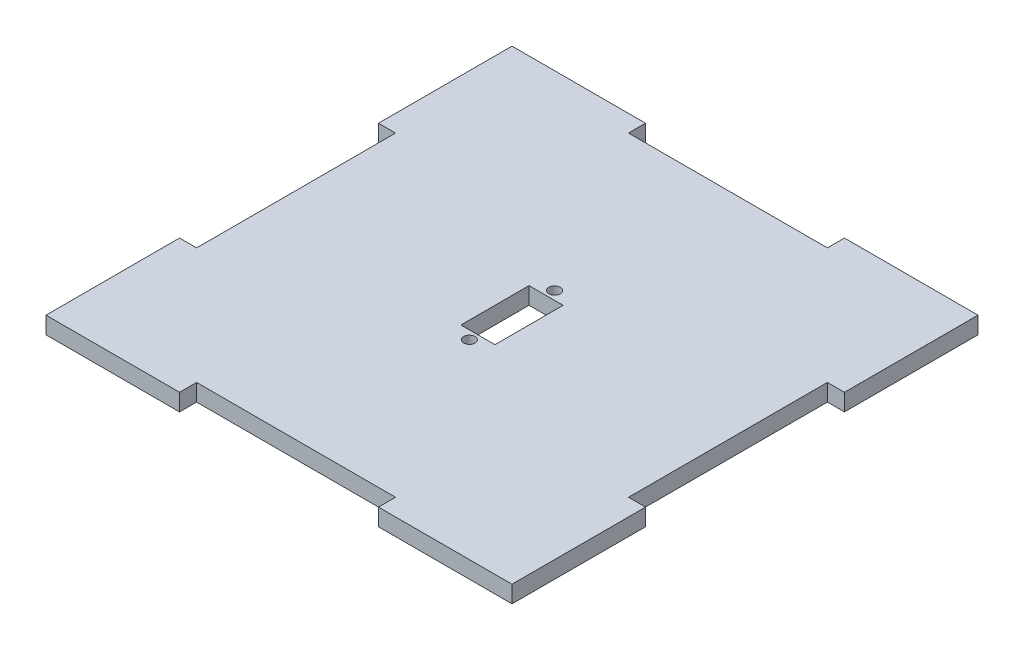
ISO-10303-21;
HEADER;
FILE_DESCRIPTION(('STEP AP214'),'2;1');
FILE_NAME('part.step','',(''),(''),'','','');
FILE_SCHEMA(('AUTOMOTIVE_DESIGN { 1 0 10303 214 1 1 1 1 }'));
ENDSEC;
DATA;
#1=APPLICATION_CONTEXT('core data for automotive mechanical design processes');
#2=APPLICATION_PROTOCOL_DEFINITION('international standard','automotive_design',2000,#1);
#3=PRODUCT_CONTEXT('',#1,'mechanical');
#4=PRODUCT('Part','Part','',(#3));
#5=PRODUCT_RELATED_PRODUCT_CATEGORY('part','',(#4));
#6=PRODUCT_DEFINITION_FORMATION('','',#4);
#7=PRODUCT_DEFINITION_CONTEXT('part definition',#1,'design');
#8=PRODUCT_DEFINITION('design','',#6,#7);
#9=PRODUCT_DEFINITION_SHAPE('','',#8);
#10=(LENGTH_UNIT() NAMED_UNIT(*) SI_UNIT(.MILLI.,.METRE.));
#11=(NAMED_UNIT(*) PLANE_ANGLE_UNIT() SI_UNIT($,.RADIAN.));
#12=(NAMED_UNIT(*) SI_UNIT($,.STERADIAN.) SOLID_ANGLE_UNIT());
#13=UNCERTAINTY_MEASURE_WITH_UNIT(LENGTH_MEASURE(1.E-05),#10,'distance_accuracy_value','');
#14=(GEOMETRIC_REPRESENTATION_CONTEXT(3) GLOBAL_UNCERTAINTY_ASSIGNED_CONTEXT((#13)) GLOBAL_UNIT_ASSIGNED_CONTEXT((#10,
#11,#12)) REPRESENTATION_CONTEXT('',''));
#15=CARTESIAN_POINT('',(0.,0.,0.));
#16=DIRECTION('',(0.,0.,1.));
#17=DIRECTION('',(1.,0.,0.));
#18=AXIS2_PLACEMENT_3D('',#15,#16,#17);
#19=CARTESIAN_POINT('',(41.,3.,-17.5));
#20=DIRECTION('',(-1.,0.,0.));
#21=DIRECTION('',(0.,0.,1.));
#22=AXIS2_PLACEMENT_3D('',#19,#20,#21);
#23=PLANE('',#22);
#24=DIRECTION('',(0.,0.,-1.));
#25=VECTOR('',#24,1.);
#26=CARTESIAN_POINT('',(41.,0.,-17.5));
#27=LINE('',#26,#25);
#28=CARTESIAN_POINT('',(41.,0.,-17.5));
#29=VERTEX_POINT('',#28);
#30=CARTESIAN_POINT('',(41.,0.,-41.));
#31=VERTEX_POINT('',#30);
#32=EDGE_CURVE('E246',#29,#31,#27,.T.);
#33=ORIENTED_EDGE('',*,*,#32,.T.);
#34=DIRECTION('',(0.,-1.,0.));
#35=VECTOR('',#34,1.);
#36=CARTESIAN_POINT('',(41.,3.,-41.));
#37=LINE('',#36,#35);
#38=CARTESIAN_POINT('',(41.,3.,-41.));
#39=VERTEX_POINT('',#38);
#40=EDGE_CURVE('E11',#39,#31,#37,.T.);
#41=ORIENTED_EDGE('',*,*,#40,.F.);
#42=DIRECTION('',(0.,0.,-1.));
#43=VECTOR('',#42,1.);
#44=CARTESIAN_POINT('',(41.,3.,-17.5));
#45=LINE('',#44,#43);
#46=CARTESIAN_POINT('',(41.,3.,-17.5));
#47=VERTEX_POINT('',#46);
#48=EDGE_CURVE('E252',#47,#39,#45,.T.);
#49=ORIENTED_EDGE('',*,*,#48,.F.);
#50=DIRECTION('',(0.,-1.,0.));
#51=VECTOR('',#50,1.);
#52=CARTESIAN_POINT('',(41.,3.,-17.5));
#53=LINE('',#52,#51);
#54=EDGE_CURVE('E314',#47,#29,#53,.T.);
#55=ORIENTED_EDGE('',*,*,#54,.T.);
#56=EDGE_LOOP('',(#33,#41,#49,#55));
#57=FACE_BOUND('',#56,.T.);
#58=ADVANCED_FACE('F38',(#57),#23,.F.);
#59=CARTESIAN_POINT('',(17.5,3.,-41.));
#60=DIRECTION('',(0.,0.,1.));
#61=DIRECTION('',(1.,0.,0.));
#62=AXIS2_PLACEMENT_3D('',#59,#60,#61);
#63=PLANE('',#62);
#64=DIRECTION('',(-1.,0.,0.));
#65=VECTOR('',#64,1.);
#66=CARTESIAN_POINT('',(17.5,0.,-41.));
#67=LINE('',#66,#65);
#68=CARTESIAN_POINT('',(17.5,0.,-41.));
#69=VERTEX_POINT('',#68);
#70=EDGE_CURVE('E318',#31,#69,#67,.T.);
#71=ORIENTED_EDGE('',*,*,#70,.T.);
#72=DIRECTION('',(0.,-1.,0.));
#73=VECTOR('',#72,1.);
#74=CARTESIAN_POINT('',(17.5,3.,-41.));
#75=LINE('',#74,#73);
#76=CARTESIAN_POINT('',(17.5,3.,-41.));
#77=VERTEX_POINT('',#76);
#78=EDGE_CURVE('E46',#77,#69,#75,.T.);
#79=ORIENTED_EDGE('',*,*,#78,.F.);
#80=DIRECTION('',(-1.,0.,0.));
#81=VECTOR('',#80,1.);
#82=CARTESIAN_POINT('',(17.5,3.,-41.));
#83=LINE('',#82,#81);
#84=EDGE_CURVE('E256',#39,#77,#83,.T.);
#85=ORIENTED_EDGE('',*,*,#84,.F.);
#86=ORIENTED_EDGE('',*,*,#40,.T.);
#87=EDGE_LOOP('',(#71,#79,#85,#86));
#88=FACE_BOUND('',#87,.T.);
#89=ADVANCED_FACE('F471',(#88),#63,.F.);
#90=CARTESIAN_POINT('',(17.5,3.,-38.));
#91=DIRECTION('',(1.,0.,0.));
#92=DIRECTION('',(0.,0.,-1.));
#93=AXIS2_PLACEMENT_3D('',#90,#91,#92);
#94=PLANE('',#93);
#95=DIRECTION('',(0.,0.,1.));
#96=VECTOR('',#95,1.);
#97=CARTESIAN_POINT('',(17.5,0.,-38.));
#98=LINE('',#97,#96);
#99=CARTESIAN_POINT('',(17.5,0.,-38.));
#100=VERTEX_POINT('',#99);
#101=EDGE_CURVE('E321',#69,#100,#98,.T.);
#102=ORIENTED_EDGE('',*,*,#101,.T.);
#103=DIRECTION('',(0.,-1.,0.));
#104=VECTOR('',#103,1.);
#105=CARTESIAN_POINT('',(17.5,3.,-38.));
#106=LINE('',#105,#104);
#107=CARTESIAN_POINT('',(17.5,3.,-38.));
#108=VERTEX_POINT('',#107);
#109=EDGE_CURVE('E441',#108,#100,#106,.T.);
#110=ORIENTED_EDGE('',*,*,#109,.F.);
#111=DIRECTION('',(0.,0.,1.));
#112=VECTOR('',#111,1.);
#113=CARTESIAN_POINT('',(17.5,3.,-38.));
#114=LINE('',#113,#112);
#115=EDGE_CURVE('E260',#77,#108,#114,.T.);
#116=ORIENTED_EDGE('',*,*,#115,.F.);
#117=ORIENTED_EDGE('',*,*,#78,.T.);
#118=EDGE_LOOP('',(#102,#110,#116,#117));
#119=FACE_BOUND('',#118,.T.);
#120=ADVANCED_FACE('F450',(#119),#94,.F.);
#121=CARTESIAN_POINT('',(-17.5,3.,-38.));
#122=DIRECTION('',(0.,0.,1.));
#123=DIRECTION('',(1.,0.,0.));
#124=AXIS2_PLACEMENT_3D('',#121,#122,#123);
#125=PLANE('',#124);
#126=DIRECTION('',(-1.,0.,0.));
#127=VECTOR('',#126,1.);
#128=CARTESIAN_POINT('',(-17.5,0.,-38.));
#129=LINE('',#128,#127);
#130=CARTESIAN_POINT('',(-17.5,0.,-38.));
#131=VERTEX_POINT('',#130);
#132=EDGE_CURVE('E324',#100,#131,#129,.T.);
#133=ORIENTED_EDGE('',*,*,#132,.T.);
#134=DIRECTION('',(0.,-1.,0.));
#135=VECTOR('',#134,1.);
#136=CARTESIAN_POINT('',(-17.5,3.,-38.));
#137=LINE('',#136,#135);
#138=CARTESIAN_POINT('',(-17.5,3.,-38.));
#139=VERTEX_POINT('',#138);
#140=EDGE_CURVE('E437',#139,#131,#137,.T.);
#141=ORIENTED_EDGE('',*,*,#140,.F.);
#142=DIRECTION('',(-1.,0.,0.));
#143=VECTOR('',#142,1.);
#144=CARTESIAN_POINT('',(-17.5,3.,-38.));
#145=LINE('',#144,#143);
#146=EDGE_CURVE('E263',#108,#139,#145,.T.);
#147=ORIENTED_EDGE('',*,*,#146,.F.);
#148=ORIENTED_EDGE('',*,*,#109,.T.);
#149=EDGE_LOOP('',(#133,#141,#147,#148));
#150=FACE_BOUND('',#149,.T.);
#151=ADVANCED_FACE('F459',(#150),#125,.F.);
#152=CARTESIAN_POINT('',(-17.5,3.,-41.));
#153=DIRECTION('',(-1.,0.,0.));
#154=DIRECTION('',(0.,0.,1.));
#155=AXIS2_PLACEMENT_3D('',#152,#153,#154);
#156=PLANE('',#155);
#157=DIRECTION('',(0.,0.,-1.));
#158=VECTOR('',#157,1.);
#159=CARTESIAN_POINT('',(-17.5,0.,-41.));
#160=LINE('',#159,#158);
#161=CARTESIAN_POINT('',(-17.5,0.,-41.));
#162=VERTEX_POINT('',#161);
#163=EDGE_CURVE('E327',#131,#162,#160,.T.);
#164=ORIENTED_EDGE('',*,*,#163,.T.);
#165=DIRECTION('',(0.,-1.,0.));
#166=VECTOR('',#165,1.);
#167=CARTESIAN_POINT('',(-17.5,3.,-41.));
#168=LINE('',#167,#166);
#169=CARTESIAN_POINT('',(-17.5,3.,-41.));
#170=VERTEX_POINT('',#169);
#171=EDGE_CURVE('E433',#170,#162,#168,.T.);
#172=ORIENTED_EDGE('',*,*,#171,.F.);
#173=DIRECTION('',(0.,0.,-1.));
#174=VECTOR('',#173,1.);
#175=CARTESIAN_POINT('',(-17.5,3.,-41.));
#176=LINE('',#175,#174);
#177=EDGE_CURVE('E266',#139,#170,#176,.T.);
#178=ORIENTED_EDGE('',*,*,#177,.F.);
#179=ORIENTED_EDGE('',*,*,#140,.T.);
#180=EDGE_LOOP('',(#164,#172,#178,#179));
#181=FACE_BOUND('',#180,.T.);
#182=ADVANCED_FACE('F463',(#181),#156,.F.);
#183=CARTESIAN_POINT('',(-41.,3.,-41.));
#184=DIRECTION('',(0.,0.,1.));
#185=DIRECTION('',(1.,0.,0.));
#186=AXIS2_PLACEMENT_3D('',#183,#184,#185);
#187=PLANE('',#186);
#188=DIRECTION('',(-1.,0.,0.));
#189=VECTOR('',#188,1.);
#190=CARTESIAN_POINT('',(-41.,0.,-41.));
#191=LINE('',#190,#189);
#192=CARTESIAN_POINT('',(-41.,0.,-41.));
#193=VERTEX_POINT('',#192);
#194=EDGE_CURVE('E330',#162,#193,#191,.T.);
#195=ORIENTED_EDGE('',*,*,#194,.T.);
#196=DIRECTION('',(0.,-1.,0.));
#197=VECTOR('',#196,1.);
#198=CARTESIAN_POINT('',(-41.,3.,-41.));
#199=LINE('',#198,#197);
#200=CARTESIAN_POINT('',(-41.,3.,-41.));
#201=VERTEX_POINT('',#200);
#202=EDGE_CURVE('E429',#201,#193,#199,.T.);
#203=ORIENTED_EDGE('',*,*,#202,.F.);
#204=DIRECTION('',(-1.,0.,0.));
#205=VECTOR('',#204,1.);
#206=CARTESIAN_POINT('',(-41.,3.,-41.));
#207=LINE('',#206,#205);
#208=EDGE_CURVE('E269',#170,#201,#207,.T.);
#209=ORIENTED_EDGE('',*,*,#208,.F.);
#210=ORIENTED_EDGE('',*,*,#171,.T.);
#211=EDGE_LOOP('',(#195,#203,#209,#210));
#212=FACE_BOUND('',#211,.T.);
#213=ADVANCED_FACE('F544',(#212),#187,.F.);
#214=CARTESIAN_POINT('',(-41.,3.,-17.5));
#215=DIRECTION('',(1.,0.,0.));
#216=DIRECTION('',(0.,0.,-1.));
#217=AXIS2_PLACEMENT_3D('',#214,#215,#216);
#218=PLANE('',#217);
#219=DIRECTION('',(0.,0.,1.));
#220=VECTOR('',#219,1.);
#221=CARTESIAN_POINT('',(-41.,0.,-17.5));
#222=LINE('',#221,#220);
#223=CARTESIAN_POINT('',(-41.,0.,-17.5));
#224=VERTEX_POINT('',#223);
#225=EDGE_CURVE('E333',#193,#224,#222,.T.);
#226=ORIENTED_EDGE('',*,*,#225,.T.);
#227=DIRECTION('',(0.,-1.,0.));
#228=VECTOR('',#227,1.);
#229=CARTESIAN_POINT('',(-41.,3.,-17.5));
#230=LINE('',#229,#228);
#231=CARTESIAN_POINT('',(-41.,3.,-17.5));
#232=VERTEX_POINT('',#231);
#233=EDGE_CURVE('E425',#232,#224,#230,.T.);
#234=ORIENTED_EDGE('',*,*,#233,.F.);
#235=DIRECTION('',(0.,0.,1.));
#236=VECTOR('',#235,1.);
#237=CARTESIAN_POINT('',(-41.,3.,-17.5));
#238=LINE('',#237,#236);
#239=EDGE_CURVE('E272',#201,#232,#238,.T.);
#240=ORIENTED_EDGE('',*,*,#239,.F.);
#241=ORIENTED_EDGE('',*,*,#202,.T.);
#242=EDGE_LOOP('',(#226,#234,#240,#241));
#243=FACE_BOUND('',#242,.T.);
#244=ADVANCED_FACE('F542',(#243),#218,.F.);
#245=CARTESIAN_POINT('',(-41.,3.,-17.5));
#246=DIRECTION('',(0.,0.,-1.));
#247=DIRECTION('',(-1.,0.,0.));
#248=AXIS2_PLACEMENT_3D('',#245,#246,#247);
#249=PLANE('',#248);
#250=DIRECTION('',(1.,0.,0.));
#251=VECTOR('',#250,1.);
#252=CARTESIAN_POINT('',(-41.,0.,-17.5));
#253=LINE('',#252,#251);
#254=CARTESIAN_POINT('',(-38.,0.,-17.5));
#255=VERTEX_POINT('',#254);
#256=EDGE_CURVE('E336',#224,#255,#253,.T.);
#257=ORIENTED_EDGE('',*,*,#256,.T.);
#258=DIRECTION('',(0.,-1.,0.));
#259=VECTOR('',#258,1.);
#260=CARTESIAN_POINT('',(-38.,3.,-17.5));
#261=LINE('',#260,#259);
#262=CARTESIAN_POINT('',(-38.,3.,-17.5));
#263=VERTEX_POINT('',#262);
#264=EDGE_CURVE('E421',#263,#255,#261,.T.);
#265=ORIENTED_EDGE('',*,*,#264,.F.);
#266=DIRECTION('',(1.,0.,0.));
#267=VECTOR('',#266,1.);
#268=CARTESIAN_POINT('',(-41.,3.,-17.5));
#269=LINE('',#268,#267);
#270=EDGE_CURVE('E275',#232,#263,#269,.T.);
#271=ORIENTED_EDGE('',*,*,#270,.F.);
#272=ORIENTED_EDGE('',*,*,#233,.T.);
#273=EDGE_LOOP('',(#257,#265,#271,#272));
#274=FACE_BOUND('',#273,.T.);
#275=ADVANCED_FACE('F537',(#274),#249,.F.);
#276=CARTESIAN_POINT('',(-38.,3.,-17.5));
#277=DIRECTION('',(1.,0.,0.));
#278=DIRECTION('',(0.,0.,-1.));
#279=AXIS2_PLACEMENT_3D('',#276,#277,#278);
#280=PLANE('',#279);
#281=DIRECTION('',(0.,0.,1.));
#282=VECTOR('',#281,1.);
#283=CARTESIAN_POINT('',(-38.,0.,-17.5));
#284=LINE('',#283,#282);
#285=CARTESIAN_POINT('',(-38.,0.,17.5));
#286=VERTEX_POINT('',#285);
#287=EDGE_CURVE('E339',#255,#286,#284,.T.);
#288=ORIENTED_EDGE('',*,*,#287,.T.);
#289=DIRECTION('',(0.,-1.,0.));
#290=VECTOR('',#289,1.);
#291=CARTESIAN_POINT('',(-38.,3.,17.5));
#292=LINE('',#291,#290);
#293=CARTESIAN_POINT('',(-38.,3.,17.5));
#294=VERTEX_POINT('',#293);
#295=EDGE_CURVE('E417',#294,#286,#292,.T.);
#296=ORIENTED_EDGE('',*,*,#295,.F.);
#297=DIRECTION('',(0.,0.,1.));
#298=VECTOR('',#297,1.);
#299=CARTESIAN_POINT('',(-38.,3.,-17.5));
#300=LINE('',#299,#298);
#301=EDGE_CURVE('E278',#263,#294,#300,.T.);
#302=ORIENTED_EDGE('',*,*,#301,.F.);
#303=ORIENTED_EDGE('',*,*,#264,.T.);
#304=EDGE_LOOP('',(#288,#296,#302,#303));
#305=FACE_BOUND('',#304,.T.);
#306=ADVANCED_FACE('F532',(#305),#280,.F.);
#307=CARTESIAN_POINT('',(-38.,3.,17.5));
#308=DIRECTION('',(0.,0.,1.));
#309=DIRECTION('',(1.,0.,0.));
#310=AXIS2_PLACEMENT_3D('',#307,#308,#309);
#311=PLANE('',#310);
#312=DIRECTION('',(-1.,0.,0.));
#313=VECTOR('',#312,1.);
#314=CARTESIAN_POINT('',(-38.,0.,17.5));
#315=LINE('',#314,#313);
#316=CARTESIAN_POINT('',(-41.,0.,17.5));
#317=VERTEX_POINT('',#316);
#318=EDGE_CURVE('E342',#286,#317,#315,.T.);
#319=ORIENTED_EDGE('',*,*,#318,.T.);
#320=DIRECTION('',(0.,-1.,0.));
#321=VECTOR('',#320,1.);
#322=CARTESIAN_POINT('',(-41.,3.,17.5));
#323=LINE('',#322,#321);
#324=CARTESIAN_POINT('',(-41.,3.,17.5));
#325=VERTEX_POINT('',#324);
#326=EDGE_CURVE('E413',#325,#317,#323,.T.);
#327=ORIENTED_EDGE('',*,*,#326,.F.);
#328=DIRECTION('',(-1.,0.,0.));
#329=VECTOR('',#328,1.);
#330=CARTESIAN_POINT('',(-38.,3.,17.5));
#331=LINE('',#330,#329);
#332=EDGE_CURVE('E281',#294,#325,#331,.T.);
#333=ORIENTED_EDGE('',*,*,#332,.F.);
#334=ORIENTED_EDGE('',*,*,#295,.T.);
#335=EDGE_LOOP('',(#319,#327,#333,#334));
#336=FACE_BOUND('',#335,.T.);
#337=ADVANCED_FACE('F528',(#336),#311,.F.);
#338=CARTESIAN_POINT('',(-41.,3.,41.));
#339=DIRECTION('',(1.,0.,0.));
#340=DIRECTION('',(0.,0.,-1.));
#341=AXIS2_PLACEMENT_3D('',#338,#339,#340);
#342=PLANE('',#341);
#343=DIRECTION('',(0.,0.,1.));
#344=VECTOR('',#343,1.);
#345=CARTESIAN_POINT('',(-41.,0.,41.));
#346=LINE('',#345,#344);
#347=CARTESIAN_POINT('',(-41.,0.,41.));
#348=VERTEX_POINT('',#347);
#349=EDGE_CURVE('E345',#317,#348,#346,.T.);
#350=ORIENTED_EDGE('',*,*,#349,.T.);
#351=DIRECTION('',(0.,-1.,0.));
#352=VECTOR('',#351,1.);
#353=CARTESIAN_POINT('',(-41.,3.,41.));
#354=LINE('',#353,#352);
#355=CARTESIAN_POINT('',(-41.,3.,41.));
#356=VERTEX_POINT('',#355);
#357=EDGE_CURVE('E409',#356,#348,#354,.T.);
#358=ORIENTED_EDGE('',*,*,#357,.F.);
#359=DIRECTION('',(0.,0.,1.));
#360=VECTOR('',#359,1.);
#361=CARTESIAN_POINT('',(-41.,3.,41.));
#362=LINE('',#361,#360);
#363=EDGE_CURVE('E284',#325,#356,#362,.T.);
#364=ORIENTED_EDGE('',*,*,#363,.F.);
#365=ORIENTED_EDGE('',*,*,#326,.T.);
#366=EDGE_LOOP('',(#350,#358,#364,#365));
#367=FACE_BOUND('',#366,.T.);
#368=ADVANCED_FACE('F523',(#367),#342,.F.);
#369=CARTESIAN_POINT('',(-41.,3.,41.));
#370=DIRECTION('',(0.,0.,-1.));
#371=DIRECTION('',(-1.,0.,0.));
#372=AXIS2_PLACEMENT_3D('',#369,#370,#371);
#373=PLANE('',#372);
#374=DIRECTION('',(1.,0.,0.));
#375=VECTOR('',#374,1.);
#376=CARTESIAN_POINT('',(-41.,0.,41.));
#377=LINE('',#376,#375);
#378=CARTESIAN_POINT('',(-17.5,0.,41.));
#379=VERTEX_POINT('',#378);
#380=EDGE_CURVE('E348',#348,#379,#377,.T.);
#381=ORIENTED_EDGE('',*,*,#380,.T.);
#382=DIRECTION('',(0.,-1.,0.));
#383=VECTOR('',#382,1.);
#384=CARTESIAN_POINT('',(-17.5,3.,41.));
#385=LINE('',#384,#383);
#386=CARTESIAN_POINT('',(-17.5,3.,41.));
#387=VERTEX_POINT('',#386);
#388=EDGE_CURVE('E405',#387,#379,#385,.T.);
#389=ORIENTED_EDGE('',*,*,#388,.F.);
#390=DIRECTION('',(1.,0.,0.));
#391=VECTOR('',#390,1.);
#392=CARTESIAN_POINT('',(-41.,3.,41.));
#393=LINE('',#392,#391);
#394=EDGE_CURVE('E287',#356,#387,#393,.T.);
#395=ORIENTED_EDGE('',*,*,#394,.F.);
#396=ORIENTED_EDGE('',*,*,#357,.T.);
#397=EDGE_LOOP('',(#381,#389,#395,#396));
#398=FACE_BOUND('',#397,.T.);
#399=ADVANCED_FACE('F517',(#398),#373,.F.);
#400=CARTESIAN_POINT('',(-17.5,3.,38.));
#401=DIRECTION('',(-1.,0.,0.));
#402=DIRECTION('',(0.,0.,1.));
#403=AXIS2_PLACEMENT_3D('',#400,#401,#402);
#404=PLANE('',#403);
#405=DIRECTION('',(0.,0.,-1.));
#406=VECTOR('',#405,1.);
#407=CARTESIAN_POINT('',(-17.5,0.,38.));
#408=LINE('',#407,#406);
#409=CARTESIAN_POINT('',(-17.5,0.,38.));
#410=VERTEX_POINT('',#409);
#411=EDGE_CURVE('E351',#379,#410,#408,.T.);
#412=ORIENTED_EDGE('',*,*,#411,.T.);
#413=DIRECTION('',(0.,-1.,0.));
#414=VECTOR('',#413,1.);
#415=CARTESIAN_POINT('',(-17.5,3.,38.));
#416=LINE('',#415,#414);
#417=CARTESIAN_POINT('',(-17.5,3.,38.));
#418=VERTEX_POINT('',#417);
#419=EDGE_CURVE('E401',#418,#410,#416,.T.);
#420=ORIENTED_EDGE('',*,*,#419,.F.);
#421=DIRECTION('',(0.,0.,-1.));
#422=VECTOR('',#421,1.);
#423=CARTESIAN_POINT('',(-17.5,3.,38.));
#424=LINE('',#423,#422);
#425=EDGE_CURVE('E290',#387,#418,#424,.T.);
#426=ORIENTED_EDGE('',*,*,#425,.F.);
#427=ORIENTED_EDGE('',*,*,#388,.T.);
#428=EDGE_LOOP('',(#412,#420,#426,#427));
#429=FACE_BOUND('',#428,.T.);
#430=ADVANCED_FACE('F513',(#429),#404,.F.);
#431=CARTESIAN_POINT('',(17.5,3.,38.));
#432=DIRECTION('',(0.,0.,-1.));
#433=DIRECTION('',(-1.,0.,0.));
#434=AXIS2_PLACEMENT_3D('',#431,#432,#433);
#435=PLANE('',#434);
#436=DIRECTION('',(1.,0.,0.));
#437=VECTOR('',#436,1.);
#438=CARTESIAN_POINT('',(17.5,0.,38.));
#439=LINE('',#438,#437);
#440=CARTESIAN_POINT('',(17.5,0.,38.));
#441=VERTEX_POINT('',#440);
#442=EDGE_CURVE('E354',#410,#441,#439,.T.);
#443=ORIENTED_EDGE('',*,*,#442,.T.);
#444=DIRECTION('',(0.,-1.,0.));
#445=VECTOR('',#444,1.);
#446=CARTESIAN_POINT('',(17.5,3.,38.));
#447=LINE('',#446,#445);
#448=CARTESIAN_POINT('',(17.5,3.,38.));
#449=VERTEX_POINT('',#448);
#450=EDGE_CURVE('E397',#449,#441,#447,.T.);
#451=ORIENTED_EDGE('',*,*,#450,.F.);
#452=DIRECTION('',(1.,0.,0.));
#453=VECTOR('',#452,1.);
#454=CARTESIAN_POINT('',(17.5,3.,38.));
#455=LINE('',#454,#453);
#456=EDGE_CURVE('E293',#418,#449,#455,.T.);
#457=ORIENTED_EDGE('',*,*,#456,.F.);
#458=ORIENTED_EDGE('',*,*,#419,.T.);
#459=EDGE_LOOP('',(#443,#451,#457,#458));
#460=FACE_BOUND('',#459,.T.);
#461=ADVANCED_FACE('F508',(#460),#435,.F.);
#462=CARTESIAN_POINT('',(17.5,3.,41.));
#463=DIRECTION('',(1.,0.,0.));
#464=DIRECTION('',(0.,0.,-1.));
#465=AXIS2_PLACEMENT_3D('',#462,#463,#464);
#466=PLANE('',#465);
#467=DIRECTION('',(0.,0.,1.));
#468=VECTOR('',#467,1.);
#469=CARTESIAN_POINT('',(17.5,0.,41.));
#470=LINE('',#469,#468);
#471=CARTESIAN_POINT('',(17.5,0.,41.));
#472=VERTEX_POINT('',#471);
#473=EDGE_CURVE('E357',#441,#472,#470,.T.);
#474=ORIENTED_EDGE('',*,*,#473,.T.);
#475=DIRECTION('',(0.,-1.,0.));
#476=VECTOR('',#475,1.);
#477=CARTESIAN_POINT('',(17.5,3.,41.));
#478=LINE('',#477,#476);
#479=CARTESIAN_POINT('',(17.5,3.,41.));
#480=VERTEX_POINT('',#479);
#481=EDGE_CURVE('E393',#480,#472,#478,.T.);
#482=ORIENTED_EDGE('',*,*,#481,.F.);
#483=DIRECTION('',(0.,0.,1.));
#484=VECTOR('',#483,1.);
#485=CARTESIAN_POINT('',(17.5,3.,41.));
#486=LINE('',#485,#484);
#487=EDGE_CURVE('E296',#449,#480,#486,.T.);
#488=ORIENTED_EDGE('',*,*,#487,.F.);
#489=ORIENTED_EDGE('',*,*,#450,.T.);
#490=EDGE_LOOP('',(#474,#482,#488,#489));
#491=FACE_BOUND('',#490,.T.);
#492=ADVANCED_FACE('F502',(#491),#466,.F.);
#493=CARTESIAN_POINT('',(17.5,3.,41.));
#494=DIRECTION('',(0.,0.,-1.));
#495=DIRECTION('',(-1.,0.,0.));
#496=AXIS2_PLACEMENT_3D('',#493,#494,#495);
#497=PLANE('',#496);
#498=DIRECTION('',(1.,0.,0.));
#499=VECTOR('',#498,1.);
#500=CARTESIAN_POINT('',(17.5,0.,41.));
#501=LINE('',#500,#499);
#502=CARTESIAN_POINT('',(41.,0.,41.));
#503=VERTEX_POINT('',#502);
#504=EDGE_CURVE('E360',#472,#503,#501,.T.);
#505=ORIENTED_EDGE('',*,*,#504,.T.);
#506=DIRECTION('',(0.,-1.,0.));
#507=VECTOR('',#506,1.);
#508=CARTESIAN_POINT('',(41.,3.,41.));
#509=LINE('',#508,#507);
#510=CARTESIAN_POINT('',(41.,3.,41.));
#511=VERTEX_POINT('',#510);
#512=EDGE_CURVE('E389',#511,#503,#509,.T.);
#513=ORIENTED_EDGE('',*,*,#512,.F.);
#514=DIRECTION('',(1.,0.,0.));
#515=VECTOR('',#514,1.);
#516=CARTESIAN_POINT('',(17.5,3.,41.));
#517=LINE('',#516,#515);
#518=EDGE_CURVE('E299',#480,#511,#517,.T.);
#519=ORIENTED_EDGE('',*,*,#518,.F.);
#520=ORIENTED_EDGE('',*,*,#481,.T.);
#521=EDGE_LOOP('',(#505,#513,#519,#520));
#522=FACE_BOUND('',#521,.T.);
#523=ADVANCED_FACE('F498',(#522),#497,.F.);
#524=CARTESIAN_POINT('',(41.,3.,41.));
#525=DIRECTION('',(-1.,0.,0.));
#526=DIRECTION('',(0.,0.,1.));
#527=AXIS2_PLACEMENT_3D('',#524,#525,#526);
#528=PLANE('',#527);
#529=DIRECTION('',(0.,0.,-1.));
#530=VECTOR('',#529,1.);
#531=CARTESIAN_POINT('',(41.,0.,41.));
#532=LINE('',#531,#530);
#533=CARTESIAN_POINT('',(41.,0.,17.5));
#534=VERTEX_POINT('',#533);
#535=EDGE_CURVE('E363',#503,#534,#532,.T.);
#536=ORIENTED_EDGE('',*,*,#535,.T.);
#537=DIRECTION('',(0.,-1.,0.));
#538=VECTOR('',#537,1.);
#539=CARTESIAN_POINT('',(41.,3.,17.5));
#540=LINE('',#539,#538);
#541=CARTESIAN_POINT('',(41.,3.,17.5));
#542=VERTEX_POINT('',#541);
#543=EDGE_CURVE('E385',#542,#534,#540,.T.);
#544=ORIENTED_EDGE('',*,*,#543,.F.);
#545=DIRECTION('',(0.,0.,-1.));
#546=VECTOR('',#545,1.);
#547=CARTESIAN_POINT('',(41.,3.,41.));
#548=LINE('',#547,#546);
#549=EDGE_CURVE('E302',#511,#542,#548,.T.);
#550=ORIENTED_EDGE('',*,*,#549,.F.);
#551=ORIENTED_EDGE('',*,*,#512,.T.);
#552=EDGE_LOOP('',(#536,#544,#550,#551));
#553=FACE_BOUND('',#552,.T.);
#554=ADVANCED_FACE('F493',(#553),#528,.F.);
#555=CARTESIAN_POINT('',(38.,3.,17.5));
#556=DIRECTION('',(0.,0.,1.));
#557=DIRECTION('',(1.,0.,0.));
#558=AXIS2_PLACEMENT_3D('',#555,#556,#557);
#559=PLANE('',#558);
#560=DIRECTION('',(-1.,0.,0.));
#561=VECTOR('',#560,1.);
#562=CARTESIAN_POINT('',(38.,0.,17.5));
#563=LINE('',#562,#561);
#564=CARTESIAN_POINT('',(38.,0.,17.5));
#565=VERTEX_POINT('',#564);
#566=EDGE_CURVE('E366',#534,#565,#563,.T.);
#567=ORIENTED_EDGE('',*,*,#566,.T.);
#568=DIRECTION('',(0.,-1.,0.));
#569=VECTOR('',#568,1.);
#570=CARTESIAN_POINT('',(38.,3.,17.5));
#571=LINE('',#570,#569);
#572=CARTESIAN_POINT('',(38.,3.,17.5));
#573=VERTEX_POINT('',#572);
#574=EDGE_CURVE('E381',#573,#565,#571,.T.);
#575=ORIENTED_EDGE('',*,*,#574,.F.);
#576=DIRECTION('',(-1.,0.,0.));
#577=VECTOR('',#576,1.);
#578=CARTESIAN_POINT('',(38.,3.,17.5));
#579=LINE('',#578,#577);
#580=EDGE_CURVE('E305',#542,#573,#579,.T.);
#581=ORIENTED_EDGE('',*,*,#580,.F.);
#582=ORIENTED_EDGE('',*,*,#543,.T.);
#583=EDGE_LOOP('',(#567,#575,#581,#582));
#584=FACE_BOUND('',#583,.T.);
#585=ADVANCED_FACE('F487',(#584),#559,.F.);
#586=CARTESIAN_POINT('',(38.,3.,-17.5));
#587=DIRECTION('',(-1.,0.,0.));
#588=DIRECTION('',(0.,0.,1.));
#589=AXIS2_PLACEMENT_3D('',#586,#587,#588);
#590=PLANE('',#589);
#591=DIRECTION('',(0.,0.,-1.));
#592=VECTOR('',#591,1.);
#593=CARTESIAN_POINT('',(38.,0.,-17.5));
#594=LINE('',#593,#592);
#595=CARTESIAN_POINT('',(38.,0.,-17.5));
#596=VERTEX_POINT('',#595);
#597=EDGE_CURVE('E369',#565,#596,#594,.T.);
#598=ORIENTED_EDGE('',*,*,#597,.T.);
#599=DIRECTION('',(0.,-1.,0.));
#600=VECTOR('',#599,1.);
#601=CARTESIAN_POINT('',(38.,3.,-17.5));
#602=LINE('',#601,#600);
#603=CARTESIAN_POINT('',(38.,3.,-17.5));
#604=VERTEX_POINT('',#603);
#605=EDGE_CURVE('E377',#604,#596,#602,.T.);
#606=ORIENTED_EDGE('',*,*,#605,.F.);
#607=DIRECTION('',(0.,0.,-1.));
#608=VECTOR('',#607,1.);
#609=CARTESIAN_POINT('',(38.,3.,-17.5));
#610=LINE('',#609,#608);
#611=EDGE_CURVE('E308',#573,#604,#610,.T.);
#612=ORIENTED_EDGE('',*,*,#611,.F.);
#613=ORIENTED_EDGE('',*,*,#574,.T.);
#614=EDGE_LOOP('',(#598,#606,#612,#613));
#615=FACE_BOUND('',#614,.T.);
#616=ADVANCED_FACE('F483',(#615),#590,.F.);
#617=CARTESIAN_POINT('',(41.,3.,-17.5));
#618=DIRECTION('',(0.,0.,-1.));
#619=DIRECTION('',(-1.,0.,0.));
#620=AXIS2_PLACEMENT_3D('',#617,#618,#619);
#621=PLANE('',#620);
#622=DIRECTION('',(1.,0.,0.));
#623=VECTOR('',#622,1.);
#624=CARTESIAN_POINT('',(41.,0.,-17.5));
#625=LINE('',#624,#623);
#626=EDGE_CURVE('E257',#596,#29,#625,.T.);
#627=ORIENTED_EDGE('',*,*,#626,.T.);
#628=ORIENTED_EDGE('',*,*,#54,.F.);
#629=DIRECTION('',(1.,0.,0.));
#630=VECTOR('',#629,1.);
#631=CARTESIAN_POINT('',(41.,3.,-17.5));
#632=LINE('',#631,#630);
#633=EDGE_CURVE('E311',#604,#47,#632,.T.);
#634=ORIENTED_EDGE('',*,*,#633,.F.);
#635=ORIENTED_EDGE('',*,*,#605,.T.);
#636=EDGE_LOOP('',(#627,#628,#634,#635));
#637=FACE_BOUND('',#636,.T.);
#638=ADVANCED_FACE('F478',(#637),#621,.F.);
#639=CARTESIAN_POINT('',(0.,3.,0.));
#640=DIRECTION('',(0.,-1.,0.));
#641=DIRECTION('',(0.,0.,-1.));
#642=AXIS2_PLACEMENT_3D('',#639,#640,#641);
#643=PLANE('',#642);
#644=CARTESIAN_POINT('',(0.,3.,7.5));
#645=DIRECTION('',(0.,1.,0.));
#646=DIRECTION('',(0.,0.,-1.));
#647=AXIS2_PLACEMENT_3D('',#644,#645,#646);
#648=CIRCLE('',#647,1.);
#649=CARTESIAN_POINT('',(0.,3.,6.5));
#650=VERTEX_POINT('',#649);
#651=EDGE_CURVE('E227',#650,#650,#648,.T.);
#652=ORIENTED_EDGE('',*,*,#651,.F.);
#653=EDGE_LOOP('',(#652));
#654=FACE_BOUND('',#653,.T.);
#655=CARTESIAN_POINT('',(0.,3.,-7.5));
#656=DIRECTION('',(0.,1.,0.));
#657=DIRECTION('',(0.,0.,1.));
#658=AXIS2_PLACEMENT_3D('',#655,#656,#657);
#659=CIRCLE('',#658,1.);
#660=CARTESIAN_POINT('',(0.,3.,-6.5));
#661=VERTEX_POINT('',#660);
#662=EDGE_CURVE('E766',#661,#661,#659,.T.);
#663=ORIENTED_EDGE('',*,*,#662,.F.);
#664=EDGE_LOOP('',(#663));
#665=FACE_BOUND('',#664,.T.);
#666=DIRECTION('',(-1.,0.,0.));
#667=VECTOR('',#666,1.);
#668=CARTESIAN_POINT('',(-3.,3.,-6.));
#669=LINE('',#668,#667);
#670=CARTESIAN_POINT('',(3.,3.,-6.));
#671=VERTEX_POINT('',#670);
#672=CARTESIAN_POINT('',(-3.,3.,-6.));
#673=VERTEX_POINT('',#672);
#674=EDGE_CURVE('E236',#671,#673,#669,.T.);
#675=ORIENTED_EDGE('',*,*,#674,.F.);
#676=DIRECTION('',(0.,0.,-1.));
#677=VECTOR('',#676,1.);
#678=CARTESIAN_POINT('',(3.,3.,-6.));
#679=LINE('',#678,#677);
#680=CARTESIAN_POINT('',(3.,3.,6.));
#681=VERTEX_POINT('',#680);
#682=EDGE_CURVE('E53',#681,#671,#679,.T.);
#683=ORIENTED_EDGE('',*,*,#682,.F.);
#684=DIRECTION('',(1.,0.,0.));
#685=VECTOR('',#684,1.);
#686=CARTESIAN_POINT('',(-3.,3.,6.));
#687=LINE('',#686,#685);
#688=CARTESIAN_POINT('',(-3.,3.,6.));
#689=VERTEX_POINT('',#688);
#690=EDGE_CURVE('E220',#689,#681,#687,.T.);
#691=ORIENTED_EDGE('',*,*,#690,.F.);
#692=DIRECTION('',(0.,0.,1.));
#693=VECTOR('',#692,1.);
#694=CARTESIAN_POINT('',(-3.,3.,-6.));
#695=LINE('',#694,#693);
#696=EDGE_CURVE('E224',#673,#689,#695,.T.);
#697=ORIENTED_EDGE('',*,*,#696,.F.);
#698=EDGE_LOOP('',(#675,#683,#691,#697));
#699=FACE_BOUND('',#698,.T.);
#700=ORIENTED_EDGE('',*,*,#48,.T.);
#701=ORIENTED_EDGE('',*,*,#84,.T.);
#702=ORIENTED_EDGE('',*,*,#115,.T.);
#703=ORIENTED_EDGE('',*,*,#146,.T.);
#704=ORIENTED_EDGE('',*,*,#177,.T.);
#705=ORIENTED_EDGE('',*,*,#208,.T.);
#706=ORIENTED_EDGE('',*,*,#239,.T.);
#707=ORIENTED_EDGE('',*,*,#270,.T.);
#708=ORIENTED_EDGE('',*,*,#301,.T.);
#709=ORIENTED_EDGE('',*,*,#332,.T.);
#710=ORIENTED_EDGE('',*,*,#363,.T.);
#711=ORIENTED_EDGE('',*,*,#394,.T.);
#712=ORIENTED_EDGE('',*,*,#425,.T.);
#713=ORIENTED_EDGE('',*,*,#456,.T.);
#714=ORIENTED_EDGE('',*,*,#487,.T.);
#715=ORIENTED_EDGE('',*,*,#518,.T.);
#716=ORIENTED_EDGE('',*,*,#549,.T.);
#717=ORIENTED_EDGE('',*,*,#580,.T.);
#718=ORIENTED_EDGE('',*,*,#611,.T.);
#719=ORIENTED_EDGE('',*,*,#633,.T.);
#720=EDGE_LOOP('',(#700,#701,#702,#703,#704,#705,#706,#707,#708,#709,#710,#711,#712,#713,#714,
#715,#716,#717,#718,#719));
#721=FACE_BOUND('',#720,.T.);
#722=ADVANCED_FACE('F467',(#654,#665,#699,#721),#643,.F.);
#723=CARTESIAN_POINT('',(0.,0.,0.));
#724=DIRECTION('',(0.,-1.,0.));
#725=DIRECTION('',(0.,0.,-1.));
#726=AXIS2_PLACEMENT_3D('',#723,#724,#725);
#727=PLANE('',#726);
#728=CARTESIAN_POINT('',(0.,0.,7.5));
#729=DIRECTION('',(0.,1.,0.));
#730=DIRECTION('',(0.,0.,-1.));
#731=AXIS2_PLACEMENT_3D('',#728,#729,#730);
#732=CIRCLE('',#731,1.);
#733=CARTESIAN_POINT('',(0.,0.,6.5));
#734=VERTEX_POINT('',#733);
#735=EDGE_CURVE('E761',#734,#734,#732,.T.);
#736=ORIENTED_EDGE('',*,*,#735,.T.);
#737=EDGE_LOOP('',(#736));
#738=FACE_BOUND('',#737,.T.);
#739=CARTESIAN_POINT('',(0.,0.,-7.5));
#740=DIRECTION('',(0.,1.,0.));
#741=DIRECTION('',(0.,0.,1.));
#742=AXIS2_PLACEMENT_3D('',#739,#740,#741);
#743=CIRCLE('',#742,1.);
#744=CARTESIAN_POINT('',(0.,0.,-6.5));
#745=VERTEX_POINT('',#744);
#746=EDGE_CURVE('E237',#745,#745,#743,.T.);
#747=ORIENTED_EDGE('',*,*,#746,.T.);
#748=EDGE_LOOP('',(#747));
#749=FACE_BOUND('',#748,.T.);
#750=DIRECTION('',(0.,0.,-1.));
#751=VECTOR('',#750,1.);
#752=CARTESIAN_POINT('',(3.,0.,-6.));
#753=LINE('',#752,#751);
#754=CARTESIAN_POINT('',(3.,0.,6.));
#755=VERTEX_POINT('',#754);
#756=CARTESIAN_POINT('',(3.,0.,-6.));
#757=VERTEX_POINT('',#756);
#758=EDGE_CURVE('E201',#755,#757,#753,.T.);
#759=ORIENTED_EDGE('',*,*,#758,.T.);
#760=DIRECTION('',(-1.,0.,0.));
#761=VECTOR('',#760,1.);
#762=CARTESIAN_POINT('',(-3.,0.,-6.));
#763=LINE('',#762,#761);
#764=CARTESIAN_POINT('',(-3.,0.,-6.));
#765=VERTEX_POINT('',#764);
#766=EDGE_CURVE('E211',#757,#765,#763,.T.);
#767=ORIENTED_EDGE('',*,*,#766,.T.);
#768=DIRECTION('',(0.,0.,1.));
#769=VECTOR('',#768,1.);
#770=CARTESIAN_POINT('',(-3.,0.,-6.));
#771=LINE('',#770,#769);
#772=CARTESIAN_POINT('',(-3.,0.,6.));
#773=VERTEX_POINT('',#772);
#774=EDGE_CURVE('E61',#765,#773,#771,.T.);
#775=ORIENTED_EDGE('',*,*,#774,.T.);
#776=DIRECTION('',(1.,0.,0.));
#777=VECTOR('',#776,1.);
#778=CARTESIAN_POINT('',(-3.,0.,6.));
#779=LINE('',#778,#777);
#780=EDGE_CURVE('E208',#773,#755,#779,.T.);
#781=ORIENTED_EDGE('',*,*,#780,.T.);
#782=EDGE_LOOP('',(#759,#767,#775,#781));
#783=FACE_BOUND('',#782,.T.);
#784=ORIENTED_EDGE('',*,*,#32,.F.);
#785=ORIENTED_EDGE('',*,*,#626,.F.);
#786=ORIENTED_EDGE('',*,*,#597,.F.);
#787=ORIENTED_EDGE('',*,*,#566,.F.);
#788=ORIENTED_EDGE('',*,*,#535,.F.);
#789=ORIENTED_EDGE('',*,*,#504,.F.);
#790=ORIENTED_EDGE('',*,*,#473,.F.);
#791=ORIENTED_EDGE('',*,*,#442,.F.);
#792=ORIENTED_EDGE('',*,*,#411,.F.);
#793=ORIENTED_EDGE('',*,*,#380,.F.);
#794=ORIENTED_EDGE('',*,*,#349,.F.);
#795=ORIENTED_EDGE('',*,*,#318,.F.);
#796=ORIENTED_EDGE('',*,*,#287,.F.);
#797=ORIENTED_EDGE('',*,*,#256,.F.);
#798=ORIENTED_EDGE('',*,*,#225,.F.);
#799=ORIENTED_EDGE('',*,*,#194,.F.);
#800=ORIENTED_EDGE('',*,*,#163,.F.);
#801=ORIENTED_EDGE('',*,*,#132,.F.);
#802=ORIENTED_EDGE('',*,*,#101,.F.);
#803=ORIENTED_EDGE('',*,*,#70,.F.);
#804=EDGE_LOOP('',(#784,#785,#786,#787,#788,#789,#790,#791,#792,#793,#794,#795,#796,#797,#798,
#799,#800,#801,#802,#803));
#805=FACE_BOUND('',#804,.T.);
#806=ADVANCED_FACE('F216',(#738,#749,#783,#805),#727,.T.);
#807=CARTESIAN_POINT('',(3.,0.,-6.));
#808=DIRECTION('',(1.,0.,0.));
#809=DIRECTION('',(0.,0.,-1.));
#810=AXIS2_PLACEMENT_3D('',#807,#808,#809);
#811=PLANE('',#810);
#812=ORIENTED_EDGE('',*,*,#682,.T.);
#813=DIRECTION('',(0.,1.,0.));
#814=VECTOR('',#813,1.);
#815=CARTESIAN_POINT('',(3.,0.,-6.));
#816=LINE('',#815,#814);
#817=EDGE_CURVE('E197',#757,#671,#816,.T.);
#818=ORIENTED_EDGE('',*,*,#817,.F.);
#819=ORIENTED_EDGE('',*,*,#758,.F.);
#820=DIRECTION('',(0.,1.,0.));
#821=VECTOR('',#820,1.);
#822=CARTESIAN_POINT('',(3.,0.,6.));
#823=LINE('',#822,#821);
#824=EDGE_CURVE('E243',#755,#681,#823,.T.);
#825=ORIENTED_EDGE('',*,*,#824,.T.);
#826=EDGE_LOOP('',(#812,#818,#819,#825));
#827=FACE_BOUND('',#826,.T.);
#828=ADVANCED_FACE('F199',(#827),#811,.F.);
#829=CARTESIAN_POINT('',(-3.,0.,6.));
#830=DIRECTION('',(0.,0.,1.));
#831=DIRECTION('',(1.,0.,0.));
#832=AXIS2_PLACEMENT_3D('',#829,#830,#831);
#833=PLANE('',#832);
#834=ORIENTED_EDGE('',*,*,#690,.T.);
#835=ORIENTED_EDGE('',*,*,#824,.F.);
#836=ORIENTED_EDGE('',*,*,#780,.F.);
#837=DIRECTION('',(0.,1.,0.));
#838=VECTOR('',#837,1.);
#839=CARTESIAN_POINT('',(-3.,0.,6.));
#840=LINE('',#839,#838);
#841=EDGE_CURVE('E247',#773,#689,#840,.T.);
#842=ORIENTED_EDGE('',*,*,#841,.T.);
#843=EDGE_LOOP('',(#834,#835,#836,#842));
#844=FACE_BOUND('',#843,.T.);
#845=ADVANCED_FACE('F708',(#844),#833,.F.);
#846=CARTESIAN_POINT('',(-3.,0.,-6.));
#847=DIRECTION('',(-1.,0.,0.));
#848=DIRECTION('',(0.,0.,1.));
#849=AXIS2_PLACEMENT_3D('',#846,#847,#848);
#850=PLANE('',#849);
#851=ORIENTED_EDGE('',*,*,#696,.T.);
#852=ORIENTED_EDGE('',*,*,#841,.F.);
#853=ORIENTED_EDGE('',*,*,#774,.F.);
#854=DIRECTION('',(0.,1.,0.));
#855=VECTOR('',#854,1.);
#856=CARTESIAN_POINT('',(-3.,0.,-6.));
#857=LINE('',#856,#855);
#858=EDGE_CURVE('E207',#765,#673,#857,.T.);
#859=ORIENTED_EDGE('',*,*,#858,.T.);
#860=EDGE_LOOP('',(#851,#852,#853,#859));
#861=FACE_BOUND('',#860,.T.);
#862=ADVANCED_FACE('F717',(#861),#850,.F.);
#863=CARTESIAN_POINT('',(-3.,0.,-6.));
#864=DIRECTION('',(0.,0.,-1.));
#865=DIRECTION('',(-1.,0.,0.));
#866=AXIS2_PLACEMENT_3D('',#863,#864,#865);
#867=PLANE('',#866);
#868=ORIENTED_EDGE('',*,*,#674,.T.);
#869=ORIENTED_EDGE('',*,*,#858,.F.);
#870=ORIENTED_EDGE('',*,*,#766,.F.);
#871=ORIENTED_EDGE('',*,*,#817,.T.);
#872=EDGE_LOOP('',(#868,#869,#870,#871));
#873=FACE_BOUND('',#872,.T.);
#874=ADVANCED_FACE('F212',(#873),#867,.F.);
#875=CARTESIAN_POINT('',(0.,0.,-7.5));
#876=DIRECTION('',(0.,1.,0.));
#877=DIRECTION('',(0.,0.,1.));
#878=AXIS2_PLACEMENT_3D('',#875,#876,#877);
#879=CYLINDRICAL_SURFACE('',#878,1.);
#880=ORIENTED_EDGE('',*,*,#746,.F.);
#881=EDGE_LOOP('',(#880));
#882=FACE_BOUND('',#881,.T.);
#883=ORIENTED_EDGE('',*,*,#662,.T.);
#884=EDGE_LOOP('',(#883));
#885=FACE_BOUND('',#884,.T.);
#886=ADVANCED_FACE('F735',(#882,#885),#879,.F.);
#887=CARTESIAN_POINT('',(0.,0.,7.5));
#888=DIRECTION('',(0.,1.,0.));
#889=DIRECTION('',(0.,0.,1.));
#890=AXIS2_PLACEMENT_3D('',#887,#888,#889);
#891=CYLINDRICAL_SURFACE('',#890,1.);
#892=ORIENTED_EDGE('',*,*,#735,.F.);
#893=EDGE_LOOP('',(#892));
#894=FACE_BOUND('',#893,.T.);
#895=ORIENTED_EDGE('',*,*,#651,.T.);
#896=EDGE_LOOP('',(#895));
#897=FACE_BOUND('',#896,.T.);
#898=ADVANCED_FACE('F744',(#894,#897),#891,.F.);
#899=CLOSED_SHELL('',(#58,#89,#120,#151,#182,#213,#244,#275,#306,#337,#368,#399,#430,#461,#492,
#523,#554,#585,#616,#638,#722,#806,#828,#845,#862,#874,#886,#898));
#900=MANIFOLD_SOLID_BREP('B2',#899);
#901=ADVANCED_BREP_SHAPE_REPRESENTATION('',(#18,#900),#14);
#902=SHAPE_DEFINITION_REPRESENTATION(#9,#901);
ENDSEC;
END-ISO-10303-21;
